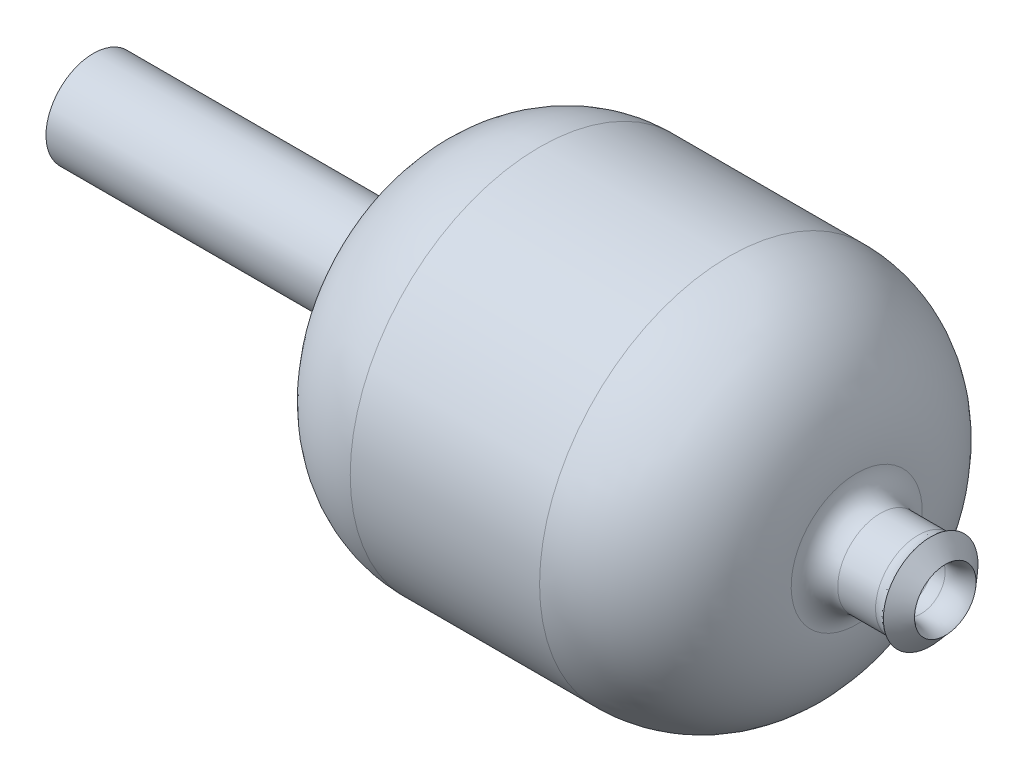
ISO-10303-21;
HEADER;
FILE_DESCRIPTION(('STEP AP214'),'2;1');
FILE_NAME('part.step','',(''),(''),'','','');
FILE_SCHEMA(('AUTOMOTIVE_DESIGN { 1 0 10303 214 1 1 1 1 }'));
ENDSEC;
DATA;
#1=APPLICATION_CONTEXT('core data for automotive mechanical design processes');
#2=APPLICATION_PROTOCOL_DEFINITION('international standard','automotive_design',2000,#1);
#3=PRODUCT_CONTEXT('',#1,'mechanical');
#4=PRODUCT('Part','Part','',(#3));
#5=PRODUCT_RELATED_PRODUCT_CATEGORY('part','',(#4));
#6=PRODUCT_DEFINITION_FORMATION('','',#4);
#7=PRODUCT_DEFINITION_CONTEXT('part definition',#1,'design');
#8=PRODUCT_DEFINITION('design','',#6,#7);
#9=PRODUCT_DEFINITION_SHAPE('','',#8);
#10=(LENGTH_UNIT() NAMED_UNIT(*) SI_UNIT(.MILLI.,.METRE.));
#11=(NAMED_UNIT(*) PLANE_ANGLE_UNIT() SI_UNIT($,.RADIAN.));
#12=(NAMED_UNIT(*) SI_UNIT($,.STERADIAN.) SOLID_ANGLE_UNIT());
#13=UNCERTAINTY_MEASURE_WITH_UNIT(LENGTH_MEASURE(1.E-05),#10,'distance_accuracy_value','');
#14=(GEOMETRIC_REPRESENTATION_CONTEXT(3) GLOBAL_UNCERTAINTY_ASSIGNED_CONTEXT((#13)) GLOBAL_UNIT_ASSIGNED_CONTEXT((#10,
#11,#12)) REPRESENTATION_CONTEXT('',''));
#15=CARTESIAN_POINT('',(0.,0.,0.));
#16=DIRECTION('',(0.,0.,1.));
#17=DIRECTION('',(1.,0.,0.));
#18=AXIS2_PLACEMENT_3D('',#15,#16,#17);
#19=CARTESIAN_POINT('',(3.,0.,0.));
#20=DIRECTION('',(1.,0.,0.));
#21=DIRECTION('',(0.,1.,0.));
#22=AXIS2_PLACEMENT_3D('',#19,#20,#21);
#23=TOROIDAL_SURFACE('',#22,5.5,3.);
#24=CARTESIAN_POINT('',(4.98431348329844,0.,0.));
#25=DIRECTION('',(1.,0.,0.));
#26=DIRECTION('',(0.,1.,0.));
#27=AXIS2_PLACEMENT_3D('',#24,#25,#26);
#28=CIRCLE('',#27,3.25);
#29=CARTESIAN_POINT('',(4.98431348329844,3.25,0.));
#30=VERTEX_POINT('',#29);
#31=EDGE_CURVE('E10',#30,#30,#28,.T.);
#32=ORIENTED_EDGE('',*,*,#31,.T.);
#33=EDGE_LOOP('',(#32));
#34=FACE_BOUND('',#33,.T.);
#35=CARTESIAN_POINT('',(2.41477739644775,0.,0.));
#36=DIRECTION('',(1.,0.,0.));
#37=DIRECTION('',(0.,1.,0.));
#38=AXIS2_PLACEMENT_3D('',#35,#36,#37);
#39=CIRCLE('',#38,2.5576345393049);
#40=CARTESIAN_POINT('',(2.41477739644775,2.5576345393049,0.));
#41=VERTEX_POINT('',#40);
#42=EDGE_CURVE('E92',#41,#41,#39,.T.);
#43=ORIENTED_EDGE('',*,*,#42,.F.);
#44=EDGE_LOOP('',(#43));
#45=FACE_BOUND('',#44,.T.);
#46=ADVANCED_FACE('F28',(#34,#45),#23,.T.);
#47=CARTESIAN_POINT('',(4.98431348329844,0.,0.));
#48=DIRECTION('',(-1.,0.,0.));
#49=DIRECTION('',(0.,-1.,0.));
#50=AXIS2_PLACEMENT_3D('',#47,#48,#49);
#51=CONICAL_SURFACE('',#50,3.25,0.84806207898148);
#52=CARTESIAN_POINT('',(3.4409585518441,0.,0.));
#53=DIRECTION('',(1.,0.,0.));
#54=DIRECTION('',(0.,1.,0.));
#55=AXIS2_PLACEMENT_3D('',#52,#53,#54);
#56=CIRCLE('',#55,5.);
#57=CARTESIAN_POINT('',(3.4409585518441,5.,0.));
#58=VERTEX_POINT('',#57);
#59=EDGE_CURVE('E34',#58,#58,#56,.T.);
#60=ORIENTED_EDGE('',*,*,#59,.T.);
#61=EDGE_LOOP('',(#60));
#62=FACE_BOUND('',#61,.T.);
#63=ORIENTED_EDGE('',*,*,#31,.F.);
#64=EDGE_LOOP('',(#63));
#65=FACE_BOUND('',#64,.T.);
#66=ADVANCED_FACE('F100',(#62,#65),#51,.T.);
#67=CARTESIAN_POINT('',(2.1180828963118,0.,0.));
#68=DIRECTION('',(1.,0.,0.));
#69=DIRECTION('',(0.,1.,0.));
#70=AXIS2_PLACEMENT_3D('',#67,#68,#69);
#71=TOROIDAL_SURFACE('',#70,6.5,2.);
#72=CARTESIAN_POINT('',(2.1180828963118,0.,0.));
#73=DIRECTION('',(1.,0.,0.));
#74=DIRECTION('',(0.,1.,0.));
#75=AXIS2_PLACEMENT_3D('',#72,#73,#74);
#76=CIRCLE('',#75,4.5);
#77=CARTESIAN_POINT('',(2.1180828963118,4.5,0.));
#78=VERTEX_POINT('',#77);
#79=EDGE_CURVE('E38',#78,#78,#76,.T.);
#80=ORIENTED_EDGE('',*,*,#79,.T.);
#81=EDGE_LOOP('',(#80));
#82=FACE_BOUND('',#81,.T.);
#83=ORIENTED_EDGE('',*,*,#59,.F.);
#84=EDGE_LOOP('',(#83));
#85=FACE_BOUND('',#84,.T.);
#86=ADVANCED_FACE('F104',(#82,#85),#71,.F.);
#87=CARTESIAN_POINT('',(0.,0.,0.));
#88=DIRECTION('',(1.,0.,0.));
#89=DIRECTION('',(0.,1.,0.));
#90=AXIS2_PLACEMENT_3D('',#87,#88,#89);
#91=CYLINDRICAL_SURFACE('',#90,4.5);
#92=CARTESIAN_POINT('',(-1.87388315559903,0.,0.));
#93=DIRECTION('',(1.,0.,0.));
#94=DIRECTION('',(0.,1.,0.));
#95=AXIS2_PLACEMENT_3D('',#92,#93,#94);
#96=CIRCLE('',#95,4.5);
#97=CARTESIAN_POINT('',(-1.87388315559903,4.5,0.));
#98=VERTEX_POINT('',#97);
#99=EDGE_CURVE('E42',#98,#98,#96,.T.);
#100=ORIENTED_EDGE('',*,*,#99,.T.);
#101=EDGE_LOOP('',(#100));
#102=FACE_BOUND('',#101,.T.);
#103=ORIENTED_EDGE('',*,*,#79,.F.);
#104=EDGE_LOOP('',(#103));
#105=FACE_BOUND('',#104,.T.);
#106=ADVANCED_FACE('F108',(#102,#105),#91,.T.);
#107=CARTESIAN_POINT('',(-1.87388315559903,0.,0.));
#108=DIRECTION('',(1.,0.,0.));
#109=DIRECTION('',(0.,1.,0.));
#110=AXIS2_PLACEMENT_3D('',#107,#108,#109);
#111=TOROIDAL_SURFACE('',#110,7.,2.5);
#112=CARTESIAN_POINT('',(-4.3726621543052,0.,0.));
#113=DIRECTION('',(1.,0.,0.));
#114=DIRECTION('',(0.,1.,0.));
#115=AXIS2_PLACEMENT_3D('',#112,#113,#114);
#116=CIRCLE('',#115,6.921875);
#117=CARTESIAN_POINT('',(-4.3726621543052,6.921875,0.));
#118=VERTEX_POINT('',#117);
#119=EDGE_CURVE('E47',#118,#118,#116,.T.);
#120=ORIENTED_EDGE('',*,*,#119,.T.);
#121=EDGE_LOOP('',(#120));
#122=FACE_BOUND('',#121,.T.);
#123=ORIENTED_EDGE('',*,*,#99,.F.);
#124=EDGE_LOOP('',(#123));
#125=FACE_BOUND('',#124,.T.);
#126=ADVANCED_FACE('F115',(#122,#125),#111,.F.);
#127=CARTESIAN_POINT('',(-17.8660687473185,0.,0.));
#128=DIRECTION('',(1.,0.,0.));
#129=DIRECTION('',(0.,1.,0.));
#130=AXIS2_PLACEMENT_3D('',#127,#128,#129);
#131=DEGENERATE_TOROIDAL_SURFACE('',#130,6.5,13.5,.T.);
#132=CARTESIAN_POINT('',(-17.8660687473185,0.,0.));
#133=DIRECTION('',(1.,0.,0.));
#134=DIRECTION('',(0.,1.,0.));
#135=AXIS2_PLACEMENT_3D('',#132,#133,#134);
#136=CIRCLE('',#135,20.);
#137=CARTESIAN_POINT('',(-17.8660687473185,20.,0.));
#138=VERTEX_POINT('',#137);
#139=EDGE_CURVE('E50',#138,#138,#136,.T.);
#140=ORIENTED_EDGE('',*,*,#139,.T.);
#141=EDGE_LOOP('',(#140));
#142=FACE_BOUND('',#141,.T.);
#143=ORIENTED_EDGE('',*,*,#119,.F.);
#144=EDGE_LOOP('',(#143));
#145=FACE_BOUND('',#144,.T.);
#146=ADVANCED_FACE('F119',(#142,#145),#131,.T.);
#147=CARTESIAN_POINT('',(0.,0.,0.));
#148=DIRECTION('',(1.,0.,0.));
#149=DIRECTION('',(0.,1.,0.));
#150=AXIS2_PLACEMENT_3D('',#147,#148,#149);
#151=CYLINDRICAL_SURFACE('',#150,20.);
#152=CARTESIAN_POINT('',(-37.8660687473185,0.,0.));
#153=DIRECTION('',(1.,0.,0.));
#154=DIRECTION('',(0.,1.,0.));
#155=AXIS2_PLACEMENT_3D('',#152,#153,#154);
#156=CIRCLE('',#155,20.);
#157=CARTESIAN_POINT('',(-37.8660687473185,20.,0.));
#158=VERTEX_POINT('',#157);
#159=EDGE_CURVE('E53',#158,#158,#156,.T.);
#160=ORIENTED_EDGE('',*,*,#159,.T.);
#161=EDGE_LOOP('',(#160));
#162=FACE_BOUND('',#161,.T.);
#163=ORIENTED_EDGE('',*,*,#139,.F.);
#164=EDGE_LOOP('',(#163));
#165=FACE_BOUND('',#164,.T.);
#166=ADVANCED_FACE('F123',(#162,#165),#151,.T.);
#167=CARTESIAN_POINT('',(-37.8660687473185,0.,0.));
#168=DIRECTION('',(1.,0.,0.));
#169=DIRECTION('',(0.,1.,0.));
#170=AXIS2_PLACEMENT_3D('',#167,#168,#169);
#171=DEGENERATE_TOROIDAL_SURFACE('',#170,6.5,13.5,.T.);
#172=CARTESIAN_POINT('',(-51.3101678860817,0.,0.));
#173=DIRECTION('',(1.,0.,0.));
#174=DIRECTION('',(0.,1.,0.));
#175=AXIS2_PLACEMENT_3D('',#172,#173,#174);
#176=CIRCLE('',#175,7.72727272727273);
#177=CARTESIAN_POINT('',(-51.3101678860817,7.72727272727272,0.));
#178=VERTEX_POINT('',#177);
#179=EDGE_CURVE('E56',#178,#178,#176,.T.);
#180=ORIENTED_EDGE('',*,*,#179,.T.);
#181=EDGE_LOOP('',(#180));
#182=FACE_BOUND('',#181,.T.);
#183=ORIENTED_EDGE('',*,*,#159,.F.);
#184=EDGE_LOOP('',(#183));
#185=FACE_BOUND('',#184,.T.);
#186=ADVANCED_FACE('F127',(#182,#185),#171,.T.);
#187=CARTESIAN_POINT('',(-54.2977454724735,0.,0.));
#188=DIRECTION('',(1.,0.,0.));
#189=DIRECTION('',(0.,1.,0.));
#190=AXIS2_PLACEMENT_3D('',#187,#188,#189);
#191=TOROIDAL_SURFACE('',#190,8.,3.);
#192=CARTESIAN_POINT('',(-54.2977454724735,0.,0.));
#193=DIRECTION('',(1.,0.,0.));
#194=DIRECTION('',(0.,1.,0.));
#195=AXIS2_PLACEMENT_3D('',#192,#193,#194);
#196=CIRCLE('',#195,5.);
#197=CARTESIAN_POINT('',(-54.2977454724735,4.99999999999999,0.));
#198=VERTEX_POINT('',#197);
#199=EDGE_CURVE('E59',#198,#198,#196,.T.);
#200=ORIENTED_EDGE('',*,*,#199,.T.);
#201=EDGE_LOOP('',(#200));
#202=FACE_BOUND('',#201,.T.);
#203=ORIENTED_EDGE('',*,*,#179,.F.);
#204=EDGE_LOOP('',(#203));
#205=FACE_BOUND('',#204,.T.);
#206=ADVANCED_FACE('F131',(#202,#205),#191,.F.);
#207=CARTESIAN_POINT('',(0.,0.,0.));
#208=DIRECTION('',(1.,0.,0.));
#209=DIRECTION('',(0.,1.,0.));
#210=AXIS2_PLACEMENT_3D('',#207,#208,#209);
#211=CYLINDRICAL_SURFACE('',#210,5.);
#212=CARTESIAN_POINT('',(-85.,0.,0.));
#213=DIRECTION('',(1.,0.,0.));
#214=DIRECTION('',(0.,1.,0.));
#215=AXIS2_PLACEMENT_3D('',#212,#213,#214);
#216=CIRCLE('',#215,5.);
#217=CARTESIAN_POINT('',(-85.,4.99999999999999,0.));
#218=VERTEX_POINT('',#217);
#219=EDGE_CURVE('E62',#218,#218,#216,.T.);
#220=ORIENTED_EDGE('',*,*,#219,.T.);
#221=EDGE_LOOP('',(#220));
#222=FACE_BOUND('',#221,.T.);
#223=ORIENTED_EDGE('',*,*,#199,.F.);
#224=EDGE_LOOP('',(#223));
#225=FACE_BOUND('',#224,.T.);
#226=ADVANCED_FACE('F135',(#222,#225),#211,.T.);
#227=CARTESIAN_POINT('',(-85.,4.99999999999999,0.));
#228=DIRECTION('',(-1.,0.,0.));
#229=DIRECTION('',(0.,-1.,0.));
#230=AXIS2_PLACEMENT_3D('',#227,#228,#229);
#231=PLANE('',#230);
#232=CARTESIAN_POINT('',(-85.,0.,0.));
#233=DIRECTION('',(1.,0.,0.));
#234=DIRECTION('',(0.,1.,0.));
#235=AXIS2_PLACEMENT_3D('',#232,#233,#234);
#236=CIRCLE('',#235,3.);
#237=CARTESIAN_POINT('',(-85.,2.99999999999999,0.));
#238=VERTEX_POINT('',#237);
#239=EDGE_CURVE('E65',#238,#238,#236,.T.);
#240=ORIENTED_EDGE('',*,*,#239,.T.);
#241=EDGE_LOOP('',(#240));
#242=FACE_BOUND('',#241,.T.);
#243=ORIENTED_EDGE('',*,*,#219,.F.);
#244=EDGE_LOOP('',(#243));
#245=FACE_BOUND('',#244,.T.);
#246=ADVANCED_FACE('F139',(#242,#245),#231,.T.);
#247=CARTESIAN_POINT('',(0.,0.,0.));
#248=DIRECTION('',(1.,0.,0.));
#249=DIRECTION('',(0.,1.,0.));
#250=AXIS2_PLACEMENT_3D('',#247,#248,#249);
#251=CYLINDRICAL_SURFACE('',#250,3.);
#252=CARTESIAN_POINT('',(-54.2977454724735,0.,0.));
#253=DIRECTION('',(1.,0.,0.));
#254=DIRECTION('',(0.,1.,0.));
#255=AXIS2_PLACEMENT_3D('',#252,#253,#254);
#256=CIRCLE('',#255,3.);
#257=CARTESIAN_POINT('',(-54.2977454724735,2.99999999999999,0.));
#258=VERTEX_POINT('',#257);
#259=EDGE_CURVE('E68',#258,#258,#256,.T.);
#260=ORIENTED_EDGE('',*,*,#259,.T.);
#261=EDGE_LOOP('',(#260));
#262=FACE_BOUND('',#261,.T.);
#263=ORIENTED_EDGE('',*,*,#239,.F.);
#264=EDGE_LOOP('',(#263));
#265=FACE_BOUND('',#264,.T.);
#266=ADVANCED_FACE('F143',(#262,#265),#251,.F.);
#267=CARTESIAN_POINT('',(-54.2977454724735,0.,0.));
#268=DIRECTION('',(1.,0.,0.));
#269=DIRECTION('',(0.,1.,0.));
#270=AXIS2_PLACEMENT_3D('',#267,#268,#269);
#271=TOROIDAL_SURFACE('',#270,7.43181818181818,4.43181818181818);
#272=CARTESIAN_POINT('',(-49.8659654428674,0.,0.));
#273=DIRECTION('',(1.,0.,0.));
#274=DIRECTION('',(0.,1.,0.));
#275=AXIS2_PLACEMENT_3D('',#272,#273,#274);
#276=CIRCLE('',#275,7.45020746887967);
#277=CARTESIAN_POINT('',(-49.8659654428674,7.45020746887966,0.));
#278=VERTEX_POINT('',#277);
#279=EDGE_CURVE('E71',#278,#278,#276,.T.);
#280=ORIENTED_EDGE('',*,*,#279,.T.);
#281=EDGE_LOOP('',(#280));
#282=FACE_BOUND('',#281,.T.);
#283=ORIENTED_EDGE('',*,*,#259,.F.);
#284=EDGE_LOOP('',(#283));
#285=FACE_BOUND('',#284,.T.);
#286=ADVANCED_FACE('F147',(#282,#285),#271,.T.);
#287=CARTESIAN_POINT('',(-37.8660687473185,0.,0.));
#288=DIRECTION('',(1.,0.,0.));
#289=DIRECTION('',(0.,1.,0.));
#290=AXIS2_PLACEMENT_3D('',#287,#288,#289);
#291=DEGENERATE_TOROIDAL_SURFACE('',#290,7.5,12.,.T.);
#292=CARTESIAN_POINT('',(-37.8660687473185,0.,0.));
#293=DIRECTION('',(1.,0.,0.));
#294=DIRECTION('',(0.,1.,0.));
#295=AXIS2_PLACEMENT_3D('',#292,#293,#294);
#296=CIRCLE('',#295,19.5);
#297=CARTESIAN_POINT('',(-37.8660687473185,19.5,0.));
#298=VERTEX_POINT('',#297);
#299=EDGE_CURVE('E74',#298,#298,#296,.T.);
#300=ORIENTED_EDGE('',*,*,#299,.T.);
#301=EDGE_LOOP('',(#300));
#302=FACE_BOUND('',#301,.T.);
#303=ORIENTED_EDGE('',*,*,#279,.F.);
#304=EDGE_LOOP('',(#303));
#305=FACE_BOUND('',#304,.T.);
#306=ADVANCED_FACE('F151',(#302,#305),#291,.F.);
#307=CARTESIAN_POINT('',(0.,0.,0.));
#308=DIRECTION('',(1.,0.,0.));
#309=DIRECTION('',(0.,1.,0.));
#310=AXIS2_PLACEMENT_3D('',#307,#308,#309);
#311=CYLINDRICAL_SURFACE('',#310,19.5);
#312=CARTESIAN_POINT('',(-17.8660687473185,0.,0.));
#313=DIRECTION('',(1.,0.,0.));
#314=DIRECTION('',(0.,1.,0.));
#315=AXIS2_PLACEMENT_3D('',#312,#313,#314);
#316=CIRCLE('',#315,19.5);
#317=CARTESIAN_POINT('',(-17.8660687473185,19.5,0.));
#318=VERTEX_POINT('',#317);
#319=EDGE_CURVE('E77',#318,#318,#316,.T.);
#320=ORIENTED_EDGE('',*,*,#319,.T.);
#321=EDGE_LOOP('',(#320));
#322=FACE_BOUND('',#321,.T.);
#323=ORIENTED_EDGE('',*,*,#299,.F.);
#324=EDGE_LOOP('',(#323));
#325=FACE_BOUND('',#324,.T.);
#326=ADVANCED_FACE('F155',(#322,#325),#311,.F.);
#327=CARTESIAN_POINT('',(-17.8660687473185,0.,0.));
#328=DIRECTION('',(1.,0.,0.));
#329=DIRECTION('',(0.,1.,0.));
#330=AXIS2_PLACEMENT_3D('',#327,#328,#329);
#331=DEGENERATE_TOROIDAL_SURFACE('',#330,7.5,12.,.T.);
#332=CARTESIAN_POINT('',(-5.9732137494637,0.,0.));
#333=DIRECTION('',(1.,0.,0.));
#334=DIRECTION('',(0.,1.,0.));
#335=AXIS2_PLACEMENT_3D('',#332,#333,#334);
#336=CIRCLE('',#335,5.9);
#337=CARTESIAN_POINT('',(-5.9732137494637,5.9,0.));
#338=VERTEX_POINT('',#337);
#339=EDGE_CURVE('E80',#338,#338,#336,.T.);
#340=ORIENTED_EDGE('',*,*,#339,.T.);
#341=EDGE_LOOP('',(#340));
#342=FACE_BOUND('',#341,.T.);
#343=ORIENTED_EDGE('',*,*,#319,.F.);
#344=EDGE_LOOP('',(#343));
#345=FACE_BOUND('',#344,.T.);
#346=ADVANCED_FACE('F159',(#342,#345),#331,.F.);
#347=CARTESIAN_POINT('',(-3.,0.,0.));
#348=DIRECTION('',(1.,0.,0.));
#349=DIRECTION('',(0.,1.,0.));
#350=AXIS2_PLACEMENT_3D('',#347,#348,#349);
#351=TOROIDAL_SURFACE('',#350,5.5,3.);
#352=CARTESIAN_POINT('',(-2.41477739644775,0.,0.));
#353=DIRECTION('',(1.,0.,0.));
#354=DIRECTION('',(0.,1.,0.));
#355=AXIS2_PLACEMENT_3D('',#352,#353,#354);
#356=CIRCLE('',#355,2.5576345393049);
#357=CARTESIAN_POINT('',(-2.41477739644775,2.5576345393049,0.));
#358=VERTEX_POINT('',#357);
#359=EDGE_CURVE('E83',#358,#358,#356,.T.);
#360=ORIENTED_EDGE('',*,*,#359,.T.);
#361=EDGE_LOOP('',(#360));
#362=FACE_BOUND('',#361,.T.);
#363=ORIENTED_EDGE('',*,*,#339,.F.);
#364=EDGE_LOOP('',(#363));
#365=FACE_BOUND('',#364,.T.);
#366=ADVANCED_FACE('F163',(#362,#365),#351,.T.);
#367=CARTESIAN_POINT('',(-1.63448059171141,0.,0.));
#368=DIRECTION('',(1.,0.,0.));
#369=DIRECTION('',(0.,1.,0.));
#370=AXIS2_PLACEMENT_3D('',#367,#368,#369);
#371=DEGENERATE_TOROIDAL_SURFACE('',#370,1.36551940828858,4.,.F.);
#372=CARTESIAN_POINT('',(-0.98068835502685,0.,0.));
#373=DIRECTION('',(1.,0.,0.));
#374=DIRECTION('',(0.,1.,0.));
#375=AXIS2_PLACEMENT_3D('',#372,#373,#374);
#376=CIRCLE('',#375,2.58068835502686);
#377=CARTESIAN_POINT('',(-0.980688355026851,2.58068835502686,0.));
#378=VERTEX_POINT('',#377);
#379=EDGE_CURVE('E86',#378,#378,#376,.T.);
#380=ORIENTED_EDGE('',*,*,#379,.T.);
#381=EDGE_LOOP('',(#380));
#382=FACE_BOUND('',#381,.T.);
#383=ORIENTED_EDGE('',*,*,#359,.F.);
#384=EDGE_LOOP('',(#383));
#385=FACE_BOUND('',#384,.T.);
#386=ADVANCED_FACE('F167',(#382,#385),#371,.T.);
#387=CARTESIAN_POINT('',(0.,0.,0.));
#388=DIRECTION('',(1.,0.,0.));
#389=DIRECTION('',(0.,1.,0.));
#390=AXIS2_PLACEMENT_3D('',#387,#388,#389);
#391=TOROIDAL_SURFACE('',#390,8.5,6.);
#392=CARTESIAN_POINT('',(0.980688355026849,0.,0.));
#393=DIRECTION('',(1.,0.,0.));
#394=DIRECTION('',(0.,1.,0.));
#395=AXIS2_PLACEMENT_3D('',#392,#393,#394);
#396=CIRCLE('',#395,2.58068835502685);
#397=CARTESIAN_POINT('',(0.980688355026849,2.58068835502685,0.));
#398=VERTEX_POINT('',#397);
#399=EDGE_CURVE('E89',#398,#398,#396,.T.);
#400=ORIENTED_EDGE('',*,*,#399,.T.);
#401=EDGE_LOOP('',(#400));
#402=FACE_BOUND('',#401,.T.);
#403=ORIENTED_EDGE('',*,*,#379,.F.);
#404=EDGE_LOOP('',(#403));
#405=FACE_BOUND('',#404,.T.);
#406=ADVANCED_FACE('F171',(#402,#405),#391,.T.);
#407=CARTESIAN_POINT('',(1.63448059171141,0.,0.));
#408=DIRECTION('',(1.,0.,0.));
#409=DIRECTION('',(0.,1.,0.));
#410=AXIS2_PLACEMENT_3D('',#407,#408,#409);
#411=DEGENERATE_TOROIDAL_SURFACE('',#410,1.36551940828858,4.,.F.);
#412=ORIENTED_EDGE('',*,*,#42,.T.);
#413=EDGE_LOOP('',(#412));
#414=FACE_BOUND('',#413,.T.);
#415=ORIENTED_EDGE('',*,*,#399,.F.);
#416=EDGE_LOOP('',(#415));
#417=FACE_BOUND('',#416,.T.);
#418=ADVANCED_FACE('F96',(#414,#417),#411,.T.);
#419=CLOSED_SHELL('',(#46,#66,#86,#106,#126,#146,#166,#186,#206,#226,#246,#266,#286,#306,#326,
#346,#366,#386,#406,#418));
#420=MANIFOLD_SOLID_BREP('B2',#419);
#421=ADVANCED_BREP_SHAPE_REPRESENTATION('',(#18,#420),#14);
#422=SHAPE_DEFINITION_REPRESENTATION(#9,#421);
ENDSEC;
END-ISO-10303-21;
